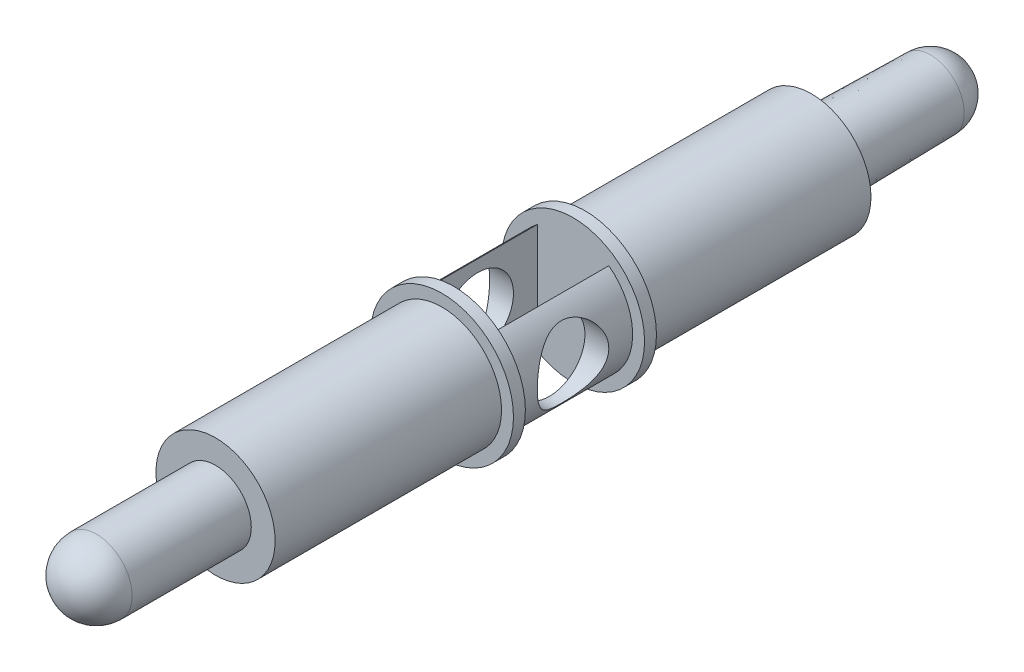
ISO-10303-21;
HEADER;
FILE_DESCRIPTION(('STEP AP214'),'2;1');
FILE_NAME('part.step','',(''),(''),'','','');
FILE_SCHEMA(('AUTOMOTIVE_DESIGN { 1 0 10303 214 1 1 1 1 }'));
ENDSEC;
DATA;
#1=APPLICATION_CONTEXT('core data for automotive mechanical design processes');
#2=APPLICATION_PROTOCOL_DEFINITION('international standard','automotive_design',2000,#1);
#3=PRODUCT_CONTEXT('',#1,'mechanical');
#4=PRODUCT('Part','Part','',(#3));
#5=PRODUCT_RELATED_PRODUCT_CATEGORY('part','',(#4));
#6=PRODUCT_DEFINITION_FORMATION('','',#4);
#7=PRODUCT_DEFINITION_CONTEXT('part definition',#1,'design');
#8=PRODUCT_DEFINITION('design','',#6,#7);
#9=PRODUCT_DEFINITION_SHAPE('','',#8);
#10=(LENGTH_UNIT() NAMED_UNIT(*) SI_UNIT(.MILLI.,.METRE.));
#11=(NAMED_UNIT(*) PLANE_ANGLE_UNIT() SI_UNIT($,.RADIAN.));
#12=(NAMED_UNIT(*) SI_UNIT($,.STERADIAN.) SOLID_ANGLE_UNIT());
#13=UNCERTAINTY_MEASURE_WITH_UNIT(LENGTH_MEASURE(1.E-05),#10,'distance_accuracy_value','');
#14=(GEOMETRIC_REPRESENTATION_CONTEXT(3) GLOBAL_UNCERTAINTY_ASSIGNED_CONTEXT((#13)) GLOBAL_UNIT_ASSIGNED_CONTEXT((#10,
#11,#12)) REPRESENTATION_CONTEXT('',''));
#15=CARTESIAN_POINT('',(0.,0.,0.));
#16=DIRECTION('',(0.,0.,1.));
#17=DIRECTION('',(1.,0.,0.));
#18=AXIS2_PLACEMENT_3D('',#15,#16,#17);
#19=CARTESIAN_POINT('',(0.,0.,50.));
#20=DIRECTION('',(0.,0.,-1.));
#21=DIRECTION('',(-1.,0.,0.));
#22=AXIS2_PLACEMENT_3D('',#19,#20,#21);
#23=CYLINDRICAL_SURFACE('',#22,5.);
#24=CARTESIAN_POINT('',(-5.,0.,28.));
#25=CARTESIAN_POINT('',(-4.99999907546385,0.0767697294351704,27.9999989437555));
#26=CARTESIAN_POINT('',(-4.99822567812271,0.153562134518387,27.9970464064299));
#27=CARTESIAN_POINT('',(-4.99118362570631,0.306548487758715,27.9852857670203));
#28=CARTESIAN_POINT('',(-4.98591292553957,0.382742059346592,27.9764742388118));
#29=CARTESIAN_POINT('',(-4.96499345352549,0.609808130024627,27.9413514405369));
#30=CARTESIAN_POINT('',(-4.94423772571335,0.758981863291667,27.9063522975666));
#31=CARTESIAN_POINT('',(-4.89123238995897,1.04754167363585,27.8152272564959));
#32=CARTESIAN_POINT('',(-4.8590397955111,1.18697226741342,27.7592060779873));
#33=CARTESIAN_POINT('',(-4.7859070225578,1.45405042800218,27.628279339403));
#34=CARTESIAN_POINT('',(-4.74496901614699,1.58170090938261,27.5533784676398));
#35=CARTESIAN_POINT('',(-4.65410731283371,1.83260160381823,27.3804503448849));
#36=CARTESIAN_POINT('',(-4.60373587041895,1.95476885986166,27.2810926088335));
#37=CARTESIAN_POINT('',(-4.50060875905921,2.1817645874806,27.0650655928078));
#38=CARTESIAN_POINT('',(-4.4478500955754,2.28657046750404,26.9483741257817));
#39=CARTESIAN_POINT('',(-4.33822134833335,2.48890019509838,26.6841529788311));
#40=CARTESIAN_POINT('',(-4.28164035635797,2.5839553962784,26.5345964578778));
#41=CARTESIAN_POINT('',(-4.17876602596121,2.74722868670786,26.2183068536731));
#42=CARTESIAN_POINT('',(-4.13245604474886,2.8154903315581,26.0516022079668));
#43=CARTESIAN_POINT('',(-4.06709259377223,2.90881204577224,25.7468070983431));
#44=CARTESIAN_POINT('',(-4.04415766338645,2.94032394587637,25.6115280016386));
#45=CARTESIAN_POINT('',(-4.01180616527621,2.98432344587083,25.3363925694786));
#46=CARTESIAN_POINT('',(-4.00237279089368,2.99683469884359,25.196542146696));
#47=CARTESIAN_POINT('',(-3.99841845126251,3.0021101681982,24.9159770073521));
#48=CARTESIAN_POINT('',(-4.00392674756739,2.99483563630785,24.7752611340881));
#49=CARTESIAN_POINT('',(-4.02906522155629,2.96092124146105,24.4974424648821));
#50=CARTESIAN_POINT('',(-4.04870602134773,2.93426681225442,24.3603424670585));
#51=CARTESIAN_POINT('',(-4.09906376582929,2.86347831933193,24.0949394577495));
#52=CARTESIAN_POINT('',(-4.12963433300037,2.8195745342289,23.9665456770055));
#53=CARTESIAN_POINT('',(-4.19854092703026,2.71590167467071,23.7186102333682));
#54=CARTESIAN_POINT('',(-4.2368797994146,2.65612678414159,23.599071836171));
#55=CARTESIAN_POINT('',(-4.32510698365562,2.5103577382067,23.3500308623437));
#56=CARTESIAN_POINT('',(-4.3758426358075,2.42160671901867,23.2224400076323));
#57=CARTESIAN_POINT('',(-4.4786102252415,2.22582963207776,22.9826508427799));
#58=CARTESIAN_POINT('',(-4.53064336077654,2.11878609335504,22.8704674345979));
#59=CARTESIAN_POINT('',(-4.63871766962914,1.87159040921357,22.6487577405515));
#60=CARTESIAN_POINT('',(-4.69430681953073,1.72890315178768,22.5417806087627));
#61=CARTESIAN_POINT('',(-4.77018325995047,1.50061053630278,22.4007312872771));
#62=CARTESIAN_POINT('',(-4.79423315237468,1.42209821815681,22.3569358644839));
#63=CARTESIAN_POINT('',(-4.83916496756429,1.26074368673913,22.276281176389));
#64=CARTESIAN_POINT('',(-4.86004883588963,1.17790417501175,22.2394176479792));
#65=CARTESIAN_POINT('',(-4.8968267274493,1.01376371174,22.1751885571434));
#66=CARTESIAN_POINT('',(-4.91295100454953,0.932690066663955,22.1473734395508));
#67=CARTESIAN_POINT('',(-4.94139126794745,0.767879949732824,22.0986660441548));
#68=CARTESIAN_POINT('',(-4.95370938553284,0.684144997174635,22.0777698915536));
#69=CARTESIAN_POINT('',(-4.97416370514887,0.514744462654421,22.0432281452752));
#70=CARTESIAN_POINT('',(-4.98230296820872,0.429080341969608,22.0295772441714));
#71=CARTESIAN_POINT('',(-4.99415996414414,0.256621746592205,22.0097338156098));
#72=CARTESIAN_POINT('',(-4.99787831889699,0.169827432617757,22.0035402391487));
#73=CARTESIAN_POINT('',(-5.00179157954795,-0.0673242571106441,21.9970073297164));
#74=CARTESIAN_POINT('',(-4.99746512571837,-0.218056842610662,22.0041884543694));
#75=CARTESIAN_POINT('',(-4.97557955020067,-0.515686907628998,22.0408455417291));
#76=CARTESIAN_POINT('',(-4.95802069684413,-0.662584464852967,22.0703210523419));
#77=CARTESIAN_POINT('',(-4.91189447655688,-0.945142599254816,22.1490884591843));
#78=CARTESIAN_POINT('',(-4.88360514429733,-1.08098954856944,22.197881126592));
#79=CARTESIAN_POINT('',(-4.81827798628348,-1.34253345184752,22.3133543242009));
#80=CARTESIAN_POINT('',(-4.78123843515362,-1.46822839746276,22.3800383825941));
#81=CARTESIAN_POINT('',(-4.69690981059277,-1.72001192130151,22.537114090978));
#82=CARTESIAN_POINT('',(-4.6489560240695,-1.84478813824221,22.6292476938375));
#83=CARTESIAN_POINT('',(-4.54948534225871,-2.07805222548222,22.8307827512548));
#84=CARTESIAN_POINT('',(-4.49796434043363,-2.18652085154156,22.9402042996027));
#85=CARTESIAN_POINT('',(-4.38890846835682,-2.39863988264158,23.1898207914932));
#86=CARTESIAN_POINT('',(-4.33146483230154,-2.49982037884172,23.332167773943));
#87=CARTESIAN_POINT('',(-4.22432364395571,-2.67690479207535,23.6344320461276));
#88=CARTESIAN_POINT('',(-4.1746179606141,-2.75283533845462,23.7943305871513));
#89=CARTESIAN_POINT('',(-4.09969818429266,-2.86285157351706,24.0924860451107));
#90=CARTESIAN_POINT('',(-4.07151318633887,-2.90243250662613,24.227960624642));
#91=CARTESIAN_POINT('',(-4.02819211510624,-2.96227327821697,24.5050641562352));
#92=CARTESIAN_POINT('',(-4.01303795327895,-2.98255990395067,24.6466842894515));
#93=CARTESIAN_POINT('',(-3.99800893189922,-3.00268261034206,24.9327538943952));
#94=CARTESIAN_POINT('',(-3.99819152744816,-3.00244179030845,25.0772119782483));
#95=CARTESIAN_POINT('',(-4.01395435932838,-2.98132945103105,25.3637888743464));
#96=CARTESIAN_POINT('',(-4.02954296823692,-2.96044671369591,25.5059063718748));
#97=CARTESIAN_POINT('',(-4.07266369966216,-2.90080351212233,25.7769768239951));
#98=CARTESIAN_POINT('',(-4.09958421715569,-2.86295284328648,25.9062341479244));
#99=CARTESIAN_POINT('',(-4.16211005816609,-2.77126473512031,26.1566745496532));
#100=CARTESIAN_POINT('',(-4.19771865147484,-2.7174212751772,26.277854565613));
#101=CARTESIAN_POINT('',(-4.28025972950371,-2.58578536859698,26.52863953946));
#102=CARTESIAN_POINT('',(-4.32809142579694,-2.50558518231556,26.6566815082148));
#103=CARTESIAN_POINT('',(-4.42640286674054,-2.32751213746958,26.8987608453066));
#104=CARTESIAN_POINT('',(-4.47688476749087,-2.22962472612067,27.0127865504796));
#105=CARTESIAN_POINT('',(-4.5845123827036,-2.00020353552556,27.2426988433295));
#106=CARTESIAN_POINT('',(-4.64140045738634,-1.86578571790514,27.3558498798616));
#107=CARTESIAN_POINT('',(-4.74731429537958,-1.57689277813436,27.5582079860481));
#108=CARTESIAN_POINT('',(-4.79633723789531,-1.42241049573676,27.6474064729197));
#109=CARTESIAN_POINT('',(-4.85920558314903,-1.18102189661686,27.7591244741905));
#110=CARTESIAN_POINT('',(-4.87817139185349,-1.10025014285136,27.7923359959645));
#111=CARTESIAN_POINT('',(-4.91243413775203,-0.935442217988391,27.8517721381435));
#112=CARTESIAN_POINT('',(-4.9277332153652,-0.851407984788105,27.8780008357009));
#113=CARTESIAN_POINT('',(-4.95415527987996,-0.68100181607457,27.9230094420757));
#114=CARTESIAN_POINT('',(-4.9652904423195,-0.594637500609296,27.9418110773033));
#115=CARTESIAN_POINT('',(-4.98308318645254,-0.420183746020764,27.971744355323));
#116=CARTESIAN_POINT('',(-4.98974449723791,-0.332095806784398,27.9828823861533));
#117=CARTESIAN_POINT('',(-4.99603728421477,-0.203123929661337,27.9933916838053));
#118=CARTESIAN_POINT('',(-4.99752198179196,-0.162556281113487,27.995868430454));
#119=CARTESIAN_POINT('',(-4.99950360169341,-0.0813278781867661,27.9991728969139));
#120=CARTESIAN_POINT('',(-5.00000048975323,-0.040667120627171,28.0000005595229));
#121=CARTESIAN_POINT('',(-5.,0.,28.));
#122=B_SPLINE_CURVE_WITH_KNOTS('',3,(#24,#25,#26,#27,#28,#29,#30,#31,#32,#33,#34,#35,#36,#37,
#38,#39,#40,#41,#42,#43,#44,#45,#46,#47,#48,#49,#50,#51,#52,#53,#54,#55,#56,#57,#58,#59,#60,#61,
#62,#63,#64,#65,#66,#67,#68,#69,#70,#71,#72,#73,#74,#75,#76,#77,#78,#79,#80,#81,#82,#83,#84,#85,
#86,#87,#88,#89,#90,#91,#92,#93,#94,#95,#96,#97,#98,#99,#100,#101,#102,#103,#104,#105,#106,#107,
#108,#109,#110,#111,#112,#113,#114,#115,#116,#117,#118,#119,#120,#121),.UNSPECIFIED.,.T.,.F.,(4,
2,2,2,2,2,2,2,2,2,2,2,2,2,2,2,2,2,2,2,2,2,2,2,2,2,2,2,2,2,2,2,2,2,2,2,2,2,2,2,2,2,2,2,2,2,2,2,
4),(0.,0.230263300595002,0.4606613693334,0.922002149276126,1.38107466343613,1.84003329022065,
2.33408870888555,2.82878205293211,3.38413315803225,3.93857770807794,4.35913349134877,
4.77916531256766,5.20002031165062,5.62119195971355,6.03692224610024,6.45280509043347,
6.94139679873936,7.43045779030958,7.98767605192993,8.26653157143431,8.54521503013734,
8.80648473589063,9.06760787545943,9.3285394673096,9.58943435026958,10.0398406663534,
10.490237849174,10.9296843257003,11.3692175250854,11.8543559282721,12.3400624135416,
12.889063860465,13.437484464234,13.8674843581987,14.2968863865712,14.7278971274535,
15.1591422350194,15.5696105785277,15.9802336423656,16.4539008129506,16.927959499309,
17.4794148474152,18.0310675325446,18.2988384573895,18.5664526907294,18.8332781687618,
19.0998809626714,19.221853785686,19.3438308395353),.UNSPECIFIED.);
#123=CARTESIAN_POINT('',(-5.,0.,28.));
#124=VERTEX_POINT('',#123);
#125=EDGE_CURVE('E102',#124,#124,#122,.T.);
#126=ORIENTED_EDGE('',*,*,#125,.F.);
#127=EDGE_LOOP('',(#126));
#128=FACE_BOUND('',#127,.T.);
#129=CARTESIAN_POINT('',(0.,0.,30.));
#130=DIRECTION('',(0.,0.,1.));
#131=DIRECTION('',(1.,0.,0.));
#132=AXIS2_PLACEMENT_3D('',#129,#130,#131);
#133=CIRCLE('',#132,5.);
#134=CARTESIAN_POINT('',(-3.,4.,30.));
#135=VERTEX_POINT('',#134);
#136=CARTESIAN_POINT('',(-3.,-4.,30.));
#137=VERTEX_POINT('',#136);
#138=EDGE_CURVE('E11',#135,#137,#133,.T.);
#139=ORIENTED_EDGE('',*,*,#138,.F.);
#140=DIRECTION('',(0.,0.,-1.));
#141=VECTOR('',#140,1.);
#142=CARTESIAN_POINT('',(-2.99999999999999,4.00000000000001,50.));
#143=LINE('',#142,#141);
#144=CARTESIAN_POINT('',(-3.,4.00000000000001,20.));
#145=VERTEX_POINT('',#144);
#146=EDGE_CURVE('E94',#145,#135,#143,.F.);
#147=ORIENTED_EDGE('',*,*,#146,.F.);
#148=CARTESIAN_POINT('',(0.,0.,20.));
#149=DIRECTION('',(0.,0.,1.));
#150=DIRECTION('',(1.,0.,0.));
#151=AXIS2_PLACEMENT_3D('',#148,#149,#150);
#152=CIRCLE('',#151,5.);
#153=CARTESIAN_POINT('',(-3.,-4.00000000000001,20.));
#154=VERTEX_POINT('',#153);
#155=EDGE_CURVE('E233',#145,#154,#152,.T.);
#156=ORIENTED_EDGE('',*,*,#155,.T.);
#157=DIRECTION('',(0.,0.,-1.));
#158=VECTOR('',#157,1.);
#159=CARTESIAN_POINT('',(-2.99999999999999,-4.00000000000001,50.));
#160=LINE('',#159,#158);
#161=EDGE_CURVE('E116',#137,#154,#160,.T.);
#162=ORIENTED_EDGE('',*,*,#161,.F.);
#163=EDGE_LOOP('',(#139,#147,#156,#162));
#164=FACE_BOUND('',#163,.T.);
#165=ADVANCED_FACE('F45',(#128,#164),#23,.T.);
#166=CARTESIAN_POINT('',(5.,0.,28.));
#167=CARTESIAN_POINT('',(4.99999907546385,-0.0767697294351704,27.9999989437555));
#168=CARTESIAN_POINT('',(4.99822567812271,-0.153562134518387,27.9970464064299));
#169=CARTESIAN_POINT('',(4.99118362570631,-0.306548487758715,27.9852857670203));
#170=CARTESIAN_POINT('',(4.98591292553957,-0.382742059346592,27.9764742388118));
#171=CARTESIAN_POINT('',(4.96499345352549,-0.609808130024627,27.9413514405369));
#172=CARTESIAN_POINT('',(4.94423772571335,-0.758981863291667,27.9063522975666));
#173=CARTESIAN_POINT('',(4.89123238995897,-1.04754167363585,27.8152272564959));
#174=CARTESIAN_POINT('',(4.8590397955111,-1.18697226741342,27.7592060779873));
#175=CARTESIAN_POINT('',(4.7859070225578,-1.45405042800218,27.628279339403));
#176=CARTESIAN_POINT('',(4.74496901614699,-1.58170090938261,27.5533784676398));
#177=CARTESIAN_POINT('',(4.65410731283371,-1.83260160381823,27.3804503448849));
#178=CARTESIAN_POINT('',(4.60373587041895,-1.95476885986166,27.2810926088335));
#179=CARTESIAN_POINT('',(4.50060875905921,-2.1817645874806,27.0650655928078));
#180=CARTESIAN_POINT('',(4.4478500955754,-2.28657046750404,26.9483741257817));
#181=CARTESIAN_POINT('',(4.33822134833335,-2.48890019509838,26.6841529788311));
#182=CARTESIAN_POINT('',(4.28164035635797,-2.5839553962784,26.5345964578778));
#183=CARTESIAN_POINT('',(4.17876602596121,-2.74722868670786,26.2183068536731));
#184=CARTESIAN_POINT('',(4.13245604474886,-2.8154903315581,26.0516022079668));
#185=CARTESIAN_POINT('',(4.06709259377223,-2.90881204577224,25.7468070983431));
#186=CARTESIAN_POINT('',(4.04415766338645,-2.94032394587637,25.6115280016386));
#187=CARTESIAN_POINT('',(4.01180616527621,-2.98432344587083,25.3363925694786));
#188=CARTESIAN_POINT('',(4.00237279089368,-2.99683469884359,25.196542146696));
#189=CARTESIAN_POINT('',(3.99841845126251,-3.0021101681982,24.9159770073521));
#190=CARTESIAN_POINT('',(4.00392674756739,-2.99483563630785,24.7752611340881));
#191=CARTESIAN_POINT('',(4.02906522155629,-2.96092124146105,24.4974424648821));
#192=CARTESIAN_POINT('',(4.04870602134773,-2.93426681225442,24.3603424670585));
#193=CARTESIAN_POINT('',(4.09906376582929,-2.86347831933193,24.0949394577495));
#194=CARTESIAN_POINT('',(4.12963433300037,-2.8195745342289,23.9665456770055));
#195=CARTESIAN_POINT('',(4.19854092703026,-2.71590167467071,23.7186102333682));
#196=CARTESIAN_POINT('',(4.2368797994146,-2.65612678414159,23.599071836171));
#197=CARTESIAN_POINT('',(4.32510698365562,-2.5103577382067,23.3500308623437));
#198=CARTESIAN_POINT('',(4.3758426358075,-2.42160671901867,23.2224400076323));
#199=CARTESIAN_POINT('',(4.4786102252415,-2.22582963207776,22.9826508427799));
#200=CARTESIAN_POINT('',(4.53064336077654,-2.11878609335504,22.8704674345979));
#201=CARTESIAN_POINT('',(4.63871766962914,-1.87159040921357,22.6487577405515));
#202=CARTESIAN_POINT('',(4.69430681953073,-1.72890315178768,22.5417806087627));
#203=CARTESIAN_POINT('',(4.77018325995047,-1.50061053630278,22.4007312872771));
#204=CARTESIAN_POINT('',(4.79423315237468,-1.42209821815681,22.3569358644839));
#205=CARTESIAN_POINT('',(4.83916496756429,-1.26074368673913,22.276281176389));
#206=CARTESIAN_POINT('',(4.86004883588963,-1.17790417501175,22.2394176479792));
#207=CARTESIAN_POINT('',(4.8968267274493,-1.01376371174,22.1751885571434));
#208=CARTESIAN_POINT('',(4.91295100454953,-0.932690066663955,22.1473734395508));
#209=CARTESIAN_POINT('',(4.94139126794745,-0.767879949732824,22.0986660441548));
#210=CARTESIAN_POINT('',(4.95370938553284,-0.684144997174635,22.0777698915536));
#211=CARTESIAN_POINT('',(4.97416370514887,-0.514744462654421,22.0432281452752));
#212=CARTESIAN_POINT('',(4.98230296820872,-0.429080341969608,22.0295772441714));
#213=CARTESIAN_POINT('',(4.99415996414414,-0.256621746592205,22.0097338156098));
#214=CARTESIAN_POINT('',(4.99787831889699,-0.169827432617757,22.0035402391487));
#215=CARTESIAN_POINT('',(5.00179157954795,0.0673242571106441,21.9970073297164));
#216=CARTESIAN_POINT('',(4.99746512571837,0.218056842610662,22.0041884543694));
#217=CARTESIAN_POINT('',(4.97557955020067,0.515686907628998,22.0408455417291));
#218=CARTESIAN_POINT('',(4.95802069684413,0.662584464852967,22.0703210523419));
#219=CARTESIAN_POINT('',(4.91189447655688,0.945142599254816,22.1490884591843));
#220=CARTESIAN_POINT('',(4.88360514429733,1.08098954856944,22.197881126592));
#221=CARTESIAN_POINT('',(4.81827798628348,1.34253345184752,22.3133543242009));
#222=CARTESIAN_POINT('',(4.78123843515362,1.46822839746276,22.3800383825941));
#223=CARTESIAN_POINT('',(4.69690981059277,1.72001192130151,22.537114090978));
#224=CARTESIAN_POINT('',(4.6489560240695,1.84478813824221,22.6292476938375));
#225=CARTESIAN_POINT('',(4.54948534225871,2.07805222548222,22.8307827512548));
#226=CARTESIAN_POINT('',(4.49796434043363,2.18652085154156,22.9402042996027));
#227=CARTESIAN_POINT('',(4.38890846835682,2.39863988264158,23.1898207914932));
#228=CARTESIAN_POINT('',(4.33146483230154,2.49982037884172,23.332167773943));
#229=CARTESIAN_POINT('',(4.22432364395571,2.67690479207535,23.6344320461276));
#230=CARTESIAN_POINT('',(4.1746179606141,2.75283533845462,23.7943305871513));
#231=CARTESIAN_POINT('',(4.09969818429266,2.86285157351706,24.0924860451107));
#232=CARTESIAN_POINT('',(4.07151318633887,2.90243250662613,24.227960624642));
#233=CARTESIAN_POINT('',(4.02819211510624,2.96227327821697,24.5050641562352));
#234=CARTESIAN_POINT('',(4.01303795327895,2.98255990395067,24.6466842894515));
#235=CARTESIAN_POINT('',(3.99800893189922,3.00268261034206,24.9327538943952));
#236=CARTESIAN_POINT('',(3.99819152744816,3.00244179030845,25.0772119782483));
#237=CARTESIAN_POINT('',(4.01395435932838,2.98132945103105,25.3637888743464));
#238=CARTESIAN_POINT('',(4.02954296823692,2.96044671369591,25.5059063718748));
#239=CARTESIAN_POINT('',(4.07266369966216,2.90080351212233,25.7769768239951));
#240=CARTESIAN_POINT('',(4.09958421715569,2.86295284328648,25.9062341479244));
#241=CARTESIAN_POINT('',(4.16211005816609,2.77126473512031,26.1566745496532));
#242=CARTESIAN_POINT('',(4.19771865147484,2.7174212751772,26.277854565613));
#243=CARTESIAN_POINT('',(4.28025972950371,2.58578536859698,26.52863953946));
#244=CARTESIAN_POINT('',(4.32809142579694,2.50558518231556,26.6566815082148));
#245=CARTESIAN_POINT('',(4.42640286674054,2.32751213746958,26.8987608453066));
#246=CARTESIAN_POINT('',(4.47688476749087,2.22962472612067,27.0127865504796));
#247=CARTESIAN_POINT('',(4.5845123827036,2.00020353552556,27.2426988433295));
#248=CARTESIAN_POINT('',(4.64140045738634,1.86578571790514,27.3558498798616));
#249=CARTESIAN_POINT('',(4.74731429537958,1.57689277813436,27.5582079860481));
#250=CARTESIAN_POINT('',(4.79633723789531,1.42241049573676,27.6474064729197));
#251=CARTESIAN_POINT('',(4.85920558314903,1.18102189661686,27.7591244741905));
#252=CARTESIAN_POINT('',(4.87817139185349,1.10025014285136,27.7923359959645));
#253=CARTESIAN_POINT('',(4.91243413775203,0.935442217988391,27.8517721381435));
#254=CARTESIAN_POINT('',(4.9277332153652,0.851407984788105,27.8780008357009));
#255=CARTESIAN_POINT('',(4.95415527987996,0.68100181607457,27.9230094420757));
#256=CARTESIAN_POINT('',(4.9652904423195,0.594637500609296,27.9418110773033));
#257=CARTESIAN_POINT('',(4.98308318645254,0.420183746020764,27.971744355323));
#258=CARTESIAN_POINT('',(4.98974449723791,0.332095806784398,27.9828823861533));
#259=CARTESIAN_POINT('',(4.99603728421477,0.203123929661337,27.9933916838053));
#260=CARTESIAN_POINT('',(4.99752198179196,0.162556281113487,27.995868430454));
#261=CARTESIAN_POINT('',(4.99950360169341,0.0813278781867661,27.9991728969139));
#262=CARTESIAN_POINT('',(5.00000048975323,0.040667120627171,28.0000005595229));
#263=CARTESIAN_POINT('',(5.,0.,28.));
#264=B_SPLINE_CURVE_WITH_KNOTS('',3,(#166,#167,#168,#169,#170,#171,#172,#173,#174,#175,#176,
#177,#178,#179,#180,#181,#182,#183,#184,#185,#186,#187,#188,#189,#190,#191,#192,#193,#194,#195,
#196,#197,#198,#199,#200,#201,#202,#203,#204,#205,#206,#207,#208,#209,#210,#211,#212,#213,#214,
#215,#216,#217,#218,#219,#220,#221,#222,#223,#224,#225,#226,#227,#228,#229,#230,#231,#232,#233,
#234,#235,#236,#237,#238,#239,#240,#241,#242,#243,#244,#245,#246,#247,#248,#249,#250,#251,#252,
#253,#254,#255,#256,#257,#258,#259,#260,#261,#262,#263),.UNSPECIFIED.,.T.,.F.,(4,2,2,2,2,2,2,2,
2,2,2,2,2,2,2,2,2,2,2,2,2,2,2,2,2,2,2,2,2,2,2,2,2,2,2,2,2,2,2,2,2,2,2,2,2,2,2,2,4),(0.,
0.230263300595002,0.4606613693334,0.922002149276126,1.38107466343613,1.84003329022065,
2.33408870888555,2.82878205293211,3.38413315803225,3.93857770807794,4.35913349134877,
4.77916531256766,5.20002031165062,5.62119195971355,6.03692224610024,6.45280509043347,
6.94139679873936,7.43045779030958,7.98767605192993,8.26653157143431,8.54521503013734,
8.80648473589063,9.06760787545943,9.3285394673096,9.58943435026958,10.0398406663534,
10.490237849174,10.9296843257003,11.3692175250854,11.8543559282721,12.3400624135416,
12.889063860465,13.437484464234,13.8674843581987,14.2968863865712,14.7278971274535,
15.1591422350194,15.5696105785277,15.9802336423656,16.4539008129506,16.927959499309,
17.4794148474152,18.0310675325446,18.2988384573895,18.5664526907294,18.8332781687618,
19.0998809626714,19.221853785686,19.3438308395353),.UNSPECIFIED.);
#265=CARTESIAN_POINT('',(5.,0.,28.));
#266=VERTEX_POINT('',#265);
#267=EDGE_CURVE('E149',#266,#266,#264,.T.);
#268=ORIENTED_EDGE('',*,*,#267,.F.);
#269=EDGE_LOOP('',(#268));
#270=FACE_BOUND('',#269,.T.);
#271=CARTESIAN_POINT('',(3.,-4.,30.));
#272=VERTEX_POINT('',#271);
#273=CARTESIAN_POINT('',(3.,4.,30.));
#274=VERTEX_POINT('',#273);
#275=EDGE_CURVE('E55',#272,#274,#133,.T.);
#276=ORIENTED_EDGE('',*,*,#275,.F.);
#277=DIRECTION('',(0.,0.,-1.));
#278=VECTOR('',#277,1.);
#279=CARTESIAN_POINT('',(3.00000000000001,-3.99999999999999,50.));
#280=LINE('',#279,#278);
#281=CARTESIAN_POINT('',(3.,-4.,20.));
#282=VERTEX_POINT('',#281);
#283=EDGE_CURVE('E99',#282,#272,#280,.F.);
#284=ORIENTED_EDGE('',*,*,#283,.F.);
#285=CARTESIAN_POINT('',(3.,4.,20.));
#286=VERTEX_POINT('',#285);
#287=EDGE_CURVE('E89',#282,#286,#152,.T.);
#288=ORIENTED_EDGE('',*,*,#287,.T.);
#289=DIRECTION('',(0.,0.,-1.));
#290=VECTOR('',#289,1.);
#291=CARTESIAN_POINT('',(3.00000000000001,3.99999999999999,50.));
#292=LINE('',#291,#290);
#293=EDGE_CURVE('E86',#274,#286,#292,.T.);
#294=ORIENTED_EDGE('',*,*,#293,.F.);
#295=EDGE_LOOP('',(#276,#284,#288,#294));
#296=FACE_BOUND('',#295,.T.);
#297=ADVANCED_FACE('F88',(#270,#296),#23,.T.);
#298=CARTESIAN_POINT('',(0.,0.,0.));
#299=DIRECTION('',(0.,0.,1.));
#300=DIRECTION('',(1.,0.,0.));
#301=AXIS2_PLACEMENT_3D('',#298,#299,#300);
#302=CIRCLE('',#301,5.);
#303=CARTESIAN_POINT('',(5.,0.,0.));
#304=VERTEX_POINT('',#303);
#305=EDGE_CURVE('E120',#304,#304,#302,.T.);
#306=ORIENTED_EDGE('',*,*,#305,.T.);
#307=EDGE_LOOP('',(#306));
#308=FACE_BOUND('',#307,.T.);
#309=CARTESIAN_POINT('',(0.,0.,19.));
#310=DIRECTION('',(0.,0.,1.));
#311=DIRECTION('',(1.,0.,0.));
#312=AXIS2_PLACEMENT_3D('',#309,#310,#311);
#313=CIRCLE('',#312,5.);
#314=CARTESIAN_POINT('',(5.,0.,19.));
#315=VERTEX_POINT('',#314);
#316=EDGE_CURVE('E93',#315,#315,#313,.T.);
#317=ORIENTED_EDGE('',*,*,#316,.F.);
#318=EDGE_LOOP('',(#317));
#319=FACE_BOUND('',#318,.T.);
#320=ADVANCED_FACE('F193',(#308,#319),#23,.T.);
#321=CARTESIAN_POINT('',(0.,0.,0.));
#322=DIRECTION('',(0.,0.,1.));
#323=DIRECTION('',(1.,0.,0.));
#324=AXIS2_PLACEMENT_3D('',#321,#322,#323);
#325=PLANE('',#324);
#326=CARTESIAN_POINT('',(0.,0.,0.));
#327=DIRECTION('',(0.,0.,-1.));
#328=DIRECTION('',(-1.,0.,0.));
#329=AXIS2_PLACEMENT_3D('',#326,#327,#328);
#330=CIRCLE('',#329,3.);
#331=CARTESIAN_POINT('',(-3.,0.,0.));
#332=VERTEX_POINT('',#331);
#333=EDGE_CURVE('E127',#332,#332,#330,.T.);
#334=ORIENTED_EDGE('',*,*,#333,.F.);
#335=EDGE_LOOP('',(#334));
#336=FACE_BOUND('',#335,.T.);
#337=ORIENTED_EDGE('',*,*,#305,.F.);
#338=EDGE_LOOP('',(#337));
#339=FACE_BOUND('',#338,.T.);
#340=ADVANCED_FACE('F188',(#336,#339),#325,.F.);
#341=CARTESIAN_POINT('',(0.,0.,0.));
#342=DIRECTION('',(0.,0.,1.));
#343=DIRECTION('',(-1.,0.,0.));
#344=AXIS2_PLACEMENT_3D('',#341,#342,#343);
#345=CONICAL_SURFACE('',#344,3.,0.0174532925199433);
#346=CARTESIAN_POINT('',(0.,0.,-10.));
#347=DIRECTION('',(0.,0.,-1.));
#348=DIRECTION('',(-1.,0.,0.));
#349=AXIS2_PLACEMENT_3D('',#346,#347,#348);
#350=CIRCLE('',#349,2.82544935071782);
#351=CARTESIAN_POINT('',(-2.82544935071782,0.,-10.));
#352=VERTEX_POINT('',#351);
#353=EDGE_CURVE('E124',#352,#352,#350,.T.);
#354=ORIENTED_EDGE('',*,*,#353,.F.);
#355=EDGE_LOOP('',(#354));
#356=FACE_BOUND('',#355,.T.);
#357=ORIENTED_EDGE('',*,*,#333,.T.);
#358=EDGE_LOOP('',(#357));
#359=FACE_BOUND('',#358,.T.);
#360=ADVANCED_FACE('F184',(#356,#359),#345,.T.);
#361=CARTESIAN_POINT('',(0.,0.,-10.));
#362=DIRECTION('',(0.,1.,0.));
#363=DIRECTION('',(-1.,0.,0.));
#364=AXIS2_PLACEMENT_3D('',#361,#362,#363);
#365=SPHERICAL_SURFACE('',#364,2.82544935071782);
#366=CARTESIAN_POINT('',(0.,0.,-10.));
#367=DIRECTION('',(0.,0.,-1.));
#368=DIRECTION('',(-1.,0.,0.));
#369=AXIS2_PLACEMENT_3D('',#366,#367,#368);
#370=SPHERICAL_SURFACE('',#369,2.82544935071782);
#371=ORIENTED_EDGE('',*,*,#353,.T.);
#372=EDGE_LOOP('',(#371));
#373=FACE_BOUND('',#372,.T.);
#374=ADVANCED_FACE('F187',(#373),#370,.T.);
#375=CARTESIAN_POINT('',(0.,0.,19.));
#376=DIRECTION('',(0.,0.,1.));
#377=DIRECTION('',(1.,0.,0.));
#378=AXIS2_PLACEMENT_3D('',#375,#376,#377);
#379=CYLINDRICAL_SURFACE('',#378,6.);
#380=CARTESIAN_POINT('',(0.,0.,19.));
#381=DIRECTION('',(0.,0.,1.));
#382=DIRECTION('',(1.,0.,0.));
#383=AXIS2_PLACEMENT_3D('',#380,#381,#382);
#384=CIRCLE('',#383,6.);
#385=CARTESIAN_POINT('',(6.,0.,19.));
#386=VERTEX_POINT('',#385);
#387=EDGE_CURVE('E222',#386,#386,#384,.T.);
#388=ORIENTED_EDGE('',*,*,#387,.T.);
#389=EDGE_LOOP('',(#388));
#390=FACE_BOUND('',#389,.T.);
#391=CARTESIAN_POINT('',(0.,0.,20.));
#392=DIRECTION('',(0.,0.,1.));
#393=DIRECTION('',(1.,0.,0.));
#394=AXIS2_PLACEMENT_3D('',#391,#392,#393);
#395=CIRCLE('',#394,6.);
#396=CARTESIAN_POINT('',(6.,0.,20.));
#397=VERTEX_POINT('',#396);
#398=EDGE_CURVE('E219',#397,#397,#395,.T.);
#399=ORIENTED_EDGE('',*,*,#398,.F.);
#400=EDGE_LOOP('',(#399));
#401=FACE_BOUND('',#400,.T.);
#402=ADVANCED_FACE('F260',(#390,#401),#379,.T.);
#403=CARTESIAN_POINT('',(0.,0.,19.));
#404=DIRECTION('',(0.,0.,1.));
#405=DIRECTION('',(1.,0.,0.));
#406=AXIS2_PLACEMENT_3D('',#403,#404,#405);
#407=PLANE('',#406);
#408=ORIENTED_EDGE('',*,*,#316,.T.);
#409=EDGE_LOOP('',(#408));
#410=FACE_BOUND('',#409,.T.);
#411=ORIENTED_EDGE('',*,*,#387,.F.);
#412=EDGE_LOOP('',(#411));
#413=FACE_BOUND('',#412,.T.);
#414=ADVANCED_FACE('F160',(#410,#413),#407,.F.);
#415=CARTESIAN_POINT('',(10.,0.,25.));
#416=DIRECTION('',(-1.,0.,0.));
#417=DIRECTION('',(0.,0.,1.));
#418=AXIS2_PLACEMENT_3D('',#415,#416,#417);
#419=CYLINDRICAL_SURFACE('',#418,3.);
#420=CARTESIAN_POINT('',(-3.,0.,25.));
#421=DIRECTION('',(1.,0.,0.));
#422=DIRECTION('',(0.,0.,-1.));
#423=AXIS2_PLACEMENT_3D('',#420,#421,#422);
#424=CIRCLE('',#423,3.);
#425=CARTESIAN_POINT('',(-3.,0.,22.));
#426=VERTEX_POINT('',#425);
#427=EDGE_CURVE('E109',#426,#426,#424,.F.);
#428=ORIENTED_EDGE('',*,*,#427,.F.);
#429=EDGE_LOOP('',(#428));
#430=FACE_BOUND('',#429,.T.);
#431=ORIENTED_EDGE('',*,*,#125,.T.);
#432=EDGE_LOOP('',(#431));
#433=FACE_BOUND('',#432,.T.);
#434=ADVANCED_FACE('F154',(#430,#433),#419,.F.);
#435=CARTESIAN_POINT('',(3.,0.,25.));
#436=DIRECTION('',(-1.,0.,0.));
#437=DIRECTION('',(0.,0.,1.));
#438=AXIS2_PLACEMENT_3D('',#435,#436,#437);
#439=CIRCLE('',#438,3.);
#440=CARTESIAN_POINT('',(3.,0.,28.));
#441=VERTEX_POINT('',#440);
#442=EDGE_CURVE('E111',#441,#441,#439,.F.);
#443=ORIENTED_EDGE('',*,*,#442,.F.);
#444=EDGE_LOOP('',(#443));
#445=FACE_BOUND('',#444,.T.);
#446=ORIENTED_EDGE('',*,*,#267,.T.);
#447=EDGE_LOOP('',(#446));
#448=FACE_BOUND('',#447,.T.);
#449=ADVANCED_FACE('F159',(#445,#448),#419,.F.);
#450=CARTESIAN_POINT('',(3.,10.,20.));
#451=DIRECTION('',(-1.,0.,0.));
#452=DIRECTION('',(0.,0.,1.));
#453=AXIS2_PLACEMENT_3D('',#450,#451,#452);
#454=PLANE('',#453);
#455=ORIENTED_EDGE('',*,*,#442,.T.);
#456=EDGE_LOOP('',(#455));
#457=FACE_BOUND('',#456,.T.);
#458=ORIENTED_EDGE('',*,*,#293,.T.);
#459=DIRECTION('',(0.,-1.,0.));
#460=VECTOR('',#459,1.);
#461=CARTESIAN_POINT('',(3.,10.,20.));
#462=LINE('',#461,#460);
#463=EDGE_CURVE('E137',#286,#282,#462,.T.);
#464=ORIENTED_EDGE('',*,*,#463,.T.);
#465=ORIENTED_EDGE('',*,*,#283,.T.);
#466=DIRECTION('',(0.,-1.,0.));
#467=VECTOR('',#466,1.);
#468=CARTESIAN_POINT('',(3.,10.,30.));
#469=LINE('',#468,#467);
#470=EDGE_CURVE('E97',#274,#272,#469,.T.);
#471=ORIENTED_EDGE('',*,*,#470,.F.);
#472=EDGE_LOOP('',(#458,#464,#465,#471));
#473=FACE_BOUND('',#472,.T.);
#474=ADVANCED_FACE('F98',(#457,#473),#454,.T.);
#475=CARTESIAN_POINT('',(-3.,10.,30.));
#476=DIRECTION('',(0.,0.,-1.));
#477=DIRECTION('',(-1.,0.,0.));
#478=AXIS2_PLACEMENT_3D('',#475,#476,#477);
#479=PLANE('',#478);
#480=ORIENTED_EDGE('',*,*,#275,.T.);
#481=ORIENTED_EDGE('',*,*,#470,.T.);
#482=EDGE_LOOP('',(#480,#481));
#483=FACE_BOUND('',#482,.T.);
#484=DIRECTION('',(0.,-1.,0.));
#485=VECTOR('',#484,1.);
#486=CARTESIAN_POINT('',(-3.,10.,30.));
#487=LINE('',#486,#485);
#488=EDGE_CURVE('E101',#135,#137,#487,.T.);
#489=ORIENTED_EDGE('',*,*,#488,.F.);
#490=ORIENTED_EDGE('',*,*,#138,.T.);
#491=EDGE_LOOP('',(#489,#490));
#492=FACE_BOUND('',#491,.T.);
#493=CARTESIAN_POINT('',(0.,0.,30.));
#494=DIRECTION('',(0.,0.,1.));
#495=DIRECTION('',(1.,0.,0.));
#496=AXIS2_PLACEMENT_3D('',#493,#494,#495);
#497=CIRCLE('',#496,6.);
#498=CARTESIAN_POINT('',(6.,0.,30.));
#499=VERTEX_POINT('',#498);
#500=EDGE_CURVE('E225',#499,#499,#497,.T.);
#501=ORIENTED_EDGE('',*,*,#500,.F.);
#502=EDGE_LOOP('',(#501));
#503=FACE_BOUND('',#502,.T.);
#504=ADVANCED_FACE('F104',(#483,#492,#503),#479,.T.);
#505=CARTESIAN_POINT('',(-3.,10.,20.));
#506=DIRECTION('',(0.,0.,1.));
#507=DIRECTION('',(1.,0.,0.));
#508=AXIS2_PLACEMENT_3D('',#505,#506,#507);
#509=PLANE('',#508);
#510=ORIENTED_EDGE('',*,*,#155,.F.);
#511=DIRECTION('',(0.,-1.,0.));
#512=VECTOR('',#511,1.);
#513=CARTESIAN_POINT('',(-3.,10.,20.));
#514=LINE('',#513,#512);
#515=EDGE_CURVE('E139',#145,#154,#514,.T.);
#516=ORIENTED_EDGE('',*,*,#515,.T.);
#517=EDGE_LOOP('',(#510,#516));
#518=FACE_BOUND('',#517,.T.);
#519=ORIENTED_EDGE('',*,*,#463,.F.);
#520=ORIENTED_EDGE('',*,*,#287,.F.);
#521=EDGE_LOOP('',(#519,#520));
#522=FACE_BOUND('',#521,.T.);
#523=ORIENTED_EDGE('',*,*,#398,.T.);
#524=EDGE_LOOP('',(#523));
#525=FACE_BOUND('',#524,.T.);
#526=ADVANCED_FACE('F167',(#518,#522,#525),#509,.T.);
#527=CARTESIAN_POINT('',(-3.,10.,20.));
#528=DIRECTION('',(1.,0.,0.));
#529=DIRECTION('',(0.,0.,-1.));
#530=AXIS2_PLACEMENT_3D('',#527,#528,#529);
#531=PLANE('',#530);
#532=ORIENTED_EDGE('',*,*,#427,.T.);
#533=EDGE_LOOP('',(#532));
#534=FACE_BOUND('',#533,.T.);
#535=ORIENTED_EDGE('',*,*,#161,.T.);
#536=ORIENTED_EDGE('',*,*,#515,.F.);
#537=ORIENTED_EDGE('',*,*,#146,.T.);
#538=ORIENTED_EDGE('',*,*,#488,.T.);
#539=EDGE_LOOP('',(#535,#536,#537,#538));
#540=FACE_BOUND('',#539,.T.);
#541=ADVANCED_FACE('F168',(#534,#540),#531,.T.);
#542=CARTESIAN_POINT('',(0.,0.,31.));
#543=DIRECTION('',(0.,0.,-1.));
#544=DIRECTION('',(-1.,0.,0.));
#545=AXIS2_PLACEMENT_3D('',#542,#543,#544);
#546=CYLINDRICAL_SURFACE('',#545,6.);
#547=CARTESIAN_POINT('',(0.,0.,31.));
#548=DIRECTION('',(0.,0.,1.));
#549=DIRECTION('',(1.,0.,0.));
#550=AXIS2_PLACEMENT_3D('',#547,#548,#549);
#551=CIRCLE('',#550,6.);
#552=CARTESIAN_POINT('',(6.,0.,31.));
#553=VERTEX_POINT('',#552);
#554=EDGE_CURVE('E220',#553,#553,#551,.T.);
#555=ORIENTED_EDGE('',*,*,#554,.F.);
#556=EDGE_LOOP('',(#555));
#557=FACE_BOUND('',#556,.T.);
#558=ORIENTED_EDGE('',*,*,#500,.T.);
#559=EDGE_LOOP('',(#558));
#560=FACE_BOUND('',#559,.T.);
#561=ADVANCED_FACE('F171',(#557,#560),#546,.T.);
#562=CARTESIAN_POINT('',(0.,0.,31.));
#563=DIRECTION('',(0.,0.,1.));
#564=DIRECTION('',(1.,0.,0.));
#565=AXIS2_PLACEMENT_3D('',#562,#563,#564);
#566=PLANE('',#565);
#567=CARTESIAN_POINT('',(0.,0.,31.));
#568=DIRECTION('',(0.,0.,1.));
#569=DIRECTION('',(1.,0.,0.));
#570=AXIS2_PLACEMENT_3D('',#567,#568,#569);
#571=CIRCLE('',#570,5.);
#572=CARTESIAN_POINT('',(5.,0.,31.));
#573=VERTEX_POINT('',#572);
#574=EDGE_CURVE('E50',#573,#573,#571,.T.);
#575=ORIENTED_EDGE('',*,*,#574,.F.);
#576=EDGE_LOOP('',(#575));
#577=FACE_BOUND('',#576,.T.);
#578=ORIENTED_EDGE('',*,*,#554,.T.);
#579=EDGE_LOOP('',(#578));
#580=FACE_BOUND('',#579,.T.);
#581=ADVANCED_FACE('F253',(#577,#580),#566,.T.);
#582=CARTESIAN_POINT('',(0.,0.,60.));
#583=DIRECTION('',(0.,1.,0.));
#584=DIRECTION('',(1.,0.,0.));
#585=AXIS2_PLACEMENT_3D('',#582,#583,#584);
#586=SPHERICAL_SURFACE('',#585,3.);
#587=CARTESIAN_POINT('',(0.,0.,60.));
#588=DIRECTION('',(0.,0.,1.));
#589=DIRECTION('',(1.,0.,0.));
#590=AXIS2_PLACEMENT_3D('',#587,#588,#589);
#591=SPHERICAL_SURFACE('',#590,3.);
#592=CARTESIAN_POINT('',(0.,0.,60.));
#593=DIRECTION('',(0.,0.,1.));
#594=DIRECTION('',(1.,0.,0.));
#595=AXIS2_PLACEMENT_3D('',#592,#593,#594);
#596=CIRCLE('',#595,3.);
#597=CARTESIAN_POINT('',(3.,0.,60.));
#598=VERTEX_POINT('',#597);
#599=EDGE_CURVE('E130',#598,#598,#596,.T.);
#600=ORIENTED_EDGE('',*,*,#599,.T.);
#601=EDGE_LOOP('',(#600));
#602=FACE_BOUND('',#601,.T.);
#603=ADVANCED_FACE('F162',(#602),#591,.T.);
#604=CARTESIAN_POINT('',(0.,0.,60.));
#605=DIRECTION('',(0.,0.,-1.));
#606=DIRECTION('',(-1.,0.,0.));
#607=AXIS2_PLACEMENT_3D('',#604,#605,#606);
#608=CYLINDRICAL_SURFACE('',#607,3.);
#609=ORIENTED_EDGE('',*,*,#599,.F.);
#610=EDGE_LOOP('',(#609));
#611=FACE_BOUND('',#610,.T.);
#612=CARTESIAN_POINT('',(0.,0.,50.));
#613=DIRECTION('',(0.,0.,1.));
#614=DIRECTION('',(1.,0.,0.));
#615=AXIS2_PLACEMENT_3D('',#612,#613,#614);
#616=CIRCLE('',#615,3.);
#617=CARTESIAN_POINT('',(3.,0.,50.));
#618=VERTEX_POINT('',#617);
#619=EDGE_CURVE('E119',#618,#618,#616,.T.);
#620=ORIENTED_EDGE('',*,*,#619,.T.);
#621=EDGE_LOOP('',(#620));
#622=FACE_BOUND('',#621,.T.);
#623=ADVANCED_FACE('F179',(#611,#622),#608,.T.);
#624=CARTESIAN_POINT('',(0.,0.,50.));
#625=DIRECTION('',(0.,0.,1.));
#626=DIRECTION('',(1.,0.,0.));
#627=AXIS2_PLACEMENT_3D('',#624,#625,#626);
#628=PLANE('',#627);
#629=ORIENTED_EDGE('',*,*,#619,.F.);
#630=EDGE_LOOP('',(#629));
#631=FACE_BOUND('',#630,.T.);
#632=CARTESIAN_POINT('',(0.,0.,50.));
#633=DIRECTION('',(0.,0.,1.));
#634=DIRECTION('',(1.,0.,0.));
#635=AXIS2_PLACEMENT_3D('',#632,#633,#634);
#636=CIRCLE('',#635,5.);
#637=CARTESIAN_POINT('',(5.,0.,50.));
#638=VERTEX_POINT('',#637);
#639=EDGE_CURVE('E123',#638,#638,#636,.T.);
#640=ORIENTED_EDGE('',*,*,#639,.T.);
#641=EDGE_LOOP('',(#640));
#642=FACE_BOUND('',#641,.T.);
#643=ADVANCED_FACE('F182',(#631,#642),#628,.T.);
#644=ORIENTED_EDGE('',*,*,#574,.T.);
#645=EDGE_LOOP('',(#644));
#646=FACE_BOUND('',#645,.T.);
#647=ORIENTED_EDGE('',*,*,#639,.F.);
#648=EDGE_LOOP('',(#647));
#649=FACE_BOUND('',#648,.T.);
#650=ADVANCED_FACE('F47',(#646,#649),#23,.T.);
#651=CLOSED_SHELL('',(#165,#297,#320,#340,#360,#374,#402,#414,#434,#449,#474,#504,#526,#541,
#561,#581,#603,#623,#643,#650));
#652=MANIFOLD_SOLID_BREP('B2',#651);
#653=ADVANCED_BREP_SHAPE_REPRESENTATION('',(#18,#652),#14);
#654=SHAPE_DEFINITION_REPRESENTATION(#9,#653);
ENDSEC;
END-ISO-10303-21;
